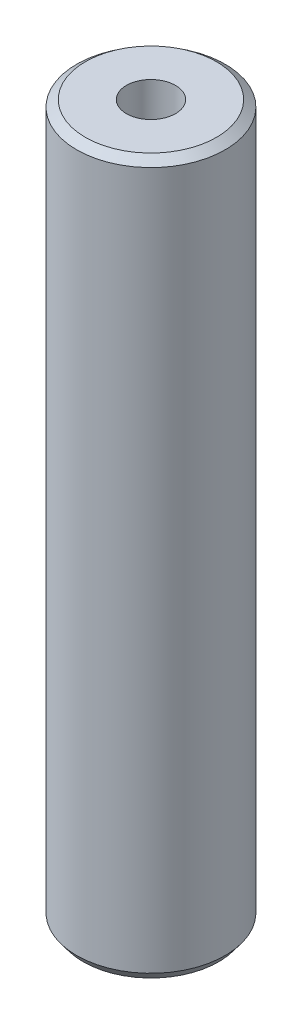
ISO-10303-21;
HEADER;
FILE_DESCRIPTION(('STEP AP214'),'2;1');
FILE_NAME('part.step','',(''),(''),'','','');
FILE_SCHEMA(('AUTOMOTIVE_DESIGN { 1 0 10303 214 1 1 1 1 }'));
ENDSEC;
DATA;
#1=APPLICATION_CONTEXT('core data for automotive mechanical design processes');
#2=APPLICATION_PROTOCOL_DEFINITION('international standard','automotive_design',2000,#1);
#3=PRODUCT_CONTEXT('',#1,'mechanical');
#4=PRODUCT('Part','Part','',(#3));
#5=PRODUCT_RELATED_PRODUCT_CATEGORY('part','',(#4));
#6=PRODUCT_DEFINITION_FORMATION('','',#4);
#7=PRODUCT_DEFINITION_CONTEXT('part definition',#1,'design');
#8=PRODUCT_DEFINITION('design','',#6,#7);
#9=PRODUCT_DEFINITION_SHAPE('','',#8);
#10=(LENGTH_UNIT() NAMED_UNIT(*) SI_UNIT(.MILLI.,.METRE.));
#11=(NAMED_UNIT(*) PLANE_ANGLE_UNIT() SI_UNIT($,.RADIAN.));
#12=(NAMED_UNIT(*) SI_UNIT($,.STERADIAN.) SOLID_ANGLE_UNIT());
#13=UNCERTAINTY_MEASURE_WITH_UNIT(LENGTH_MEASURE(1.E-05),#10,'distance_accuracy_value','');
#14=(GEOMETRIC_REPRESENTATION_CONTEXT(3) GLOBAL_UNCERTAINTY_ASSIGNED_CONTEXT((#13)) GLOBAL_UNIT_ASSIGNED_CONTEXT((#10,
#11,#12)) REPRESENTATION_CONTEXT('',''));
#15=CARTESIAN_POINT('',(0.,0.,0.));
#16=DIRECTION('',(0.,0.,1.));
#17=DIRECTION('',(1.,0.,0.));
#18=AXIS2_PLACEMENT_3D('',#15,#16,#17);
#19=CARTESIAN_POINT('',(0.,72.0261882651348,0.));
#20=DIRECTION('',(0.,-1.,0.));
#21=DIRECTION('',(0.,0.,-1.));
#22=AXIS2_PLACEMENT_3D('',#19,#20,#21);
#23=CYLINDRICAL_SURFACE('',#22,7.5);
#24=CARTESIAN_POINT('',(0.,71.3729634060728,0.));
#25=DIRECTION('',(0.,1.,0.));
#26=DIRECTION('',(0.,0.,1.));
#27=AXIS2_PLACEMENT_3D('',#24,#25,#26);
#28=CIRCLE('',#27,7.5);
#29=CARTESIAN_POINT('',(0.,71.3729634060728,7.5));
#30=VERTEX_POINT('',#29);
#31=EDGE_CURVE('E50',#30,#30,#28,.F.);
#32=ORIENTED_EDGE('',*,*,#31,.T.);
#33=EDGE_LOOP('',(#32));
#34=FACE_BOUND('',#33,.T.);
#35=CARTESIAN_POINT('',(0.,0.875293474719555,0.));
#36=DIRECTION('',(0.,1.,0.));
#37=DIRECTION('',(0.,0.,1.));
#38=AXIS2_PLACEMENT_3D('',#35,#36,#37);
#39=CIRCLE('',#38,7.5);
#40=CARTESIAN_POINT('',(0.,0.875293474719555,7.5));
#41=VERTEX_POINT('',#40);
#42=EDGE_CURVE('E51',#41,#41,#39,.T.);
#43=ORIENTED_EDGE('',*,*,#42,.T.);
#44=EDGE_LOOP('',(#43));
#45=FACE_BOUND('',#44,.T.);
#46=ADVANCED_FACE('F39',(#34,#45),#23,.T.);
#47=CARTESIAN_POINT('',(0.,72.0261882651348,0.));
#48=DIRECTION('',(0.,1.,0.));
#49=DIRECTION('',(0.,0.,1.));
#50=AXIS2_PLACEMENT_3D('',#47,#48,#49);
#51=PLANE('',#50);
#52=CARTESIAN_POINT('',(0.,72.0261882651348,0.));
#53=DIRECTION('',(0.,1.,0.));
#54=DIRECTION('',(0.,0.,1.));
#55=AXIS2_PLACEMENT_3D('',#52,#53,#54);
#56=CIRCLE('',#55,6.62470652528041);
#57=CARTESIAN_POINT('',(0.,72.0261882651348,6.62470652528041));
#58=VERTEX_POINT('',#57);
#59=EDGE_CURVE('E54',#58,#58,#56,.T.);
#60=ORIENTED_EDGE('',*,*,#59,.T.);
#61=EDGE_LOOP('',(#60));
#62=FACE_BOUND('',#61,.T.);
#63=CARTESIAN_POINT('',(0.,72.0261882651348,0.));
#64=DIRECTION('',(0.,1.,0.));
#65=DIRECTION('',(0.,0.,1.));
#66=AXIS2_PLACEMENT_3D('',#63,#64,#65);
#67=CIRCLE('',#66,2.47973042767102);
#68=CARTESIAN_POINT('',(0.,72.0261882651348,2.47973042767102));
#69=VERTEX_POINT('',#68);
#70=EDGE_CURVE('E58',#69,#69,#67,.T.);
#71=ORIENTED_EDGE('',*,*,#70,.F.);
#72=EDGE_LOOP('',(#71));
#73=FACE_BOUND('',#72,.T.);
#74=ADVANCED_FACE('F69',(#62,#73),#51,.T.);
#75=CARTESIAN_POINT('',(0.,0.,0.));
#76=DIRECTION('',(0.,1.,0.));
#77=DIRECTION('',(0.,0.,1.));
#78=AXIS2_PLACEMENT_3D('',#75,#76,#77);
#79=PLANE('',#78);
#80=CARTESIAN_POINT('',(0.,0.,0.));
#81=DIRECTION('',(0.,1.,0.));
#82=DIRECTION('',(0.,0.,1.));
#83=AXIS2_PLACEMENT_3D('',#80,#81,#82);
#84=CIRCLE('',#83,6.84677514093802);
#85=CARTESIAN_POINT('',(0.,0.,6.84677514093802));
#86=VERTEX_POINT('',#85);
#87=EDGE_CURVE('E10',#86,#86,#84,.F.);
#88=ORIENTED_EDGE('',*,*,#87,.T.);
#89=EDGE_LOOP('',(#88));
#90=FACE_BOUND('',#89,.T.);
#91=CARTESIAN_POINT('',(0.,0.,0.));
#92=DIRECTION('',(0.,1.,0.));
#93=DIRECTION('',(0.,0.,1.));
#94=AXIS2_PLACEMENT_3D('',#91,#92,#93);
#95=CIRCLE('',#94,2.47973042767102);
#96=CARTESIAN_POINT('',(0.,0.,2.47973042767102));
#97=VERTEX_POINT('',#96);
#98=EDGE_CURVE('E63',#97,#97,#95,.T.);
#99=ORIENTED_EDGE('',*,*,#98,.T.);
#100=EDGE_LOOP('',(#99));
#101=FACE_BOUND('',#100,.T.);
#102=ADVANCED_FACE('F75',(#90,#101),#79,.F.);
#103=CARTESIAN_POINT('',(0.,72.0261882651348,0.));
#104=DIRECTION('',(0.,-1.,0.));
#105=DIRECTION('',(0.,0.,-1.));
#106=AXIS2_PLACEMENT_3D('',#103,#104,#105);
#107=CYLINDRICAL_SURFACE('',#106,2.47973042767102);
#108=ORIENTED_EDGE('',*,*,#70,.T.);
#109=EDGE_LOOP('',(#108));
#110=FACE_BOUND('',#109,.T.);
#111=ORIENTED_EDGE('',*,*,#98,.F.);
#112=EDGE_LOOP('',(#111));
#113=FACE_BOUND('',#112,.T.);
#114=ADVANCED_FACE('F70',(#110,#113),#107,.F.);
#115=CARTESIAN_POINT('',(0.,72.0261882651348,0.));
#116=DIRECTION('',(0.,-1.,0.));
#117=DIRECTION('',(0.,0.,-1.));
#118=AXIS2_PLACEMENT_3D('',#115,#116,#117);
#119=CONICAL_SURFACE('',#118,6.62470652528041,0.929672314439564);
#120=ORIENTED_EDGE('',*,*,#31,.F.);
#121=EDGE_LOOP('',(#120));
#122=FACE_BOUND('',#121,.T.);
#123=ORIENTED_EDGE('',*,*,#59,.F.);
#124=EDGE_LOOP('',(#123));
#125=FACE_BOUND('',#124,.T.);
#126=ADVANCED_FACE('F81',(#122,#125),#119,.T.);
#127=CARTESIAN_POINT('',(0.,0.875293474719555,0.));
#128=DIRECTION('',(0.,1.,0.));
#129=DIRECTION('',(0.,0.,1.));
#130=AXIS2_PLACEMENT_3D('',#127,#128,#129);
#131=CONICAL_SURFACE('',#130,7.5,0.641124012355326);
#132=ORIENTED_EDGE('',*,*,#87,.F.);
#133=EDGE_LOOP('',(#132));
#134=FACE_BOUND('',#133,.T.);
#135=ORIENTED_EDGE('',*,*,#42,.F.);
#136=EDGE_LOOP('',(#135));
#137=FACE_BOUND('',#136,.T.);
#138=ADVANCED_FACE('F45',(#134,#137),#131,.T.);
#139=CLOSED_SHELL('',(#46,#74,#102,#114,#126,#138));
#140=MANIFOLD_SOLID_BREP('B2',#139);
#141=ADVANCED_BREP_SHAPE_REPRESENTATION('',(#18,#140),#14);
#142=SHAPE_DEFINITION_REPRESENTATION(#9,#141);
ENDSEC;
END-ISO-10303-21;
